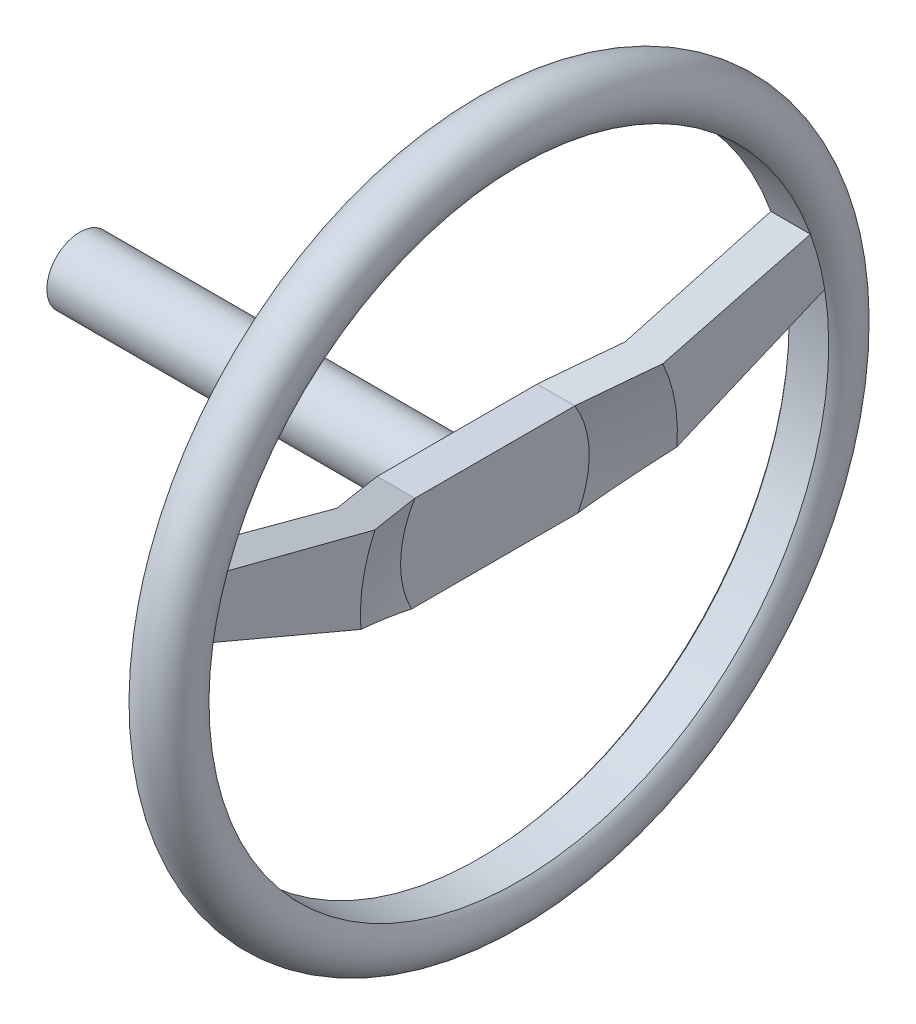
ISO-10303-21;
HEADER;
FILE_DESCRIPTION(('STEP AP214'),'2;1');
FILE_NAME('part.step','',(''),(''),'','','');
FILE_SCHEMA(('AUTOMOTIVE_DESIGN { 1 0 10303 214 1 1 1 1 }'));
ENDSEC;
DATA;
#1=APPLICATION_CONTEXT('core data for automotive mechanical design processes');
#2=APPLICATION_PROTOCOL_DEFINITION('international standard','automotive_design',2000,#1);
#3=PRODUCT_CONTEXT('',#1,'mechanical');
#4=PRODUCT('Part','Part','',(#3));
#5=PRODUCT_RELATED_PRODUCT_CATEGORY('part','',(#4));
#6=PRODUCT_DEFINITION_FORMATION('','',#4);
#7=PRODUCT_DEFINITION_CONTEXT('part definition',#1,'design');
#8=PRODUCT_DEFINITION('design','',#6,#7);
#9=PRODUCT_DEFINITION_SHAPE('','',#8);
#10=(LENGTH_UNIT() NAMED_UNIT(*) SI_UNIT(.MILLI.,.METRE.));
#11=(NAMED_UNIT(*) PLANE_ANGLE_UNIT() SI_UNIT($,.RADIAN.));
#12=(NAMED_UNIT(*) SI_UNIT($,.STERADIAN.) SOLID_ANGLE_UNIT());
#13=UNCERTAINTY_MEASURE_WITH_UNIT(LENGTH_MEASURE(1.E-05),#10,'distance_accuracy_value','');
#14=(GEOMETRIC_REPRESENTATION_CONTEXT(3) GLOBAL_UNCERTAINTY_ASSIGNED_CONTEXT((#13)) GLOBAL_UNIT_ASSIGNED_CONTEXT((#10,
#11,#12)) REPRESENTATION_CONTEXT('',''));
#15=CARTESIAN_POINT('',(0.,0.,0.));
#16=DIRECTION('',(0.,0.,1.));
#17=DIRECTION('',(1.,0.,0.));
#18=AXIS2_PLACEMENT_3D('',#15,#16,#17);
#19=CARTESIAN_POINT('',(-1.04970415300682,0.,0.));
#20=DIRECTION('',(-1.,0.,0.));
#21=DIRECTION('',(0.,0.,1.));
#22=AXIS2_PLACEMENT_3D('',#19,#20,#21);
#23=CONICAL_SURFACE('',#22,16.4284958277448,1.55840925565252);
#24=CARTESIAN_POINT('',(-0.950295846993179,0.,0.));
#25=DIRECTION('',(-1.,0.,0.));
#26=DIRECTION('',(0.,0.,1.));
#27=AXIS2_PLACEMENT_3D('',#24,#25,#26);
#28=CIRCLE('',#27,8.40373998101305);
#29=CARTESIAN_POINT('',(-0.950295846993179,-0.670509925654645,8.37694825745485));
#30=VERTEX_POINT('',#29);
#31=CARTESIAN_POINT('',(-0.950295846993179,3.52681714552161,7.62787037714538));
#32=VERTEX_POINT('',#31);
#33=EDGE_CURVE('E177',#30,#32,#28,.T.);
#34=ORIENTED_EDGE('',*,*,#33,.F.);
#35=CARTESIAN_POINT('',(-0.89432677033387,-3.5779936372377,1.51526952211852));
#36=CARTESIAN_POINT('',(-0.894305329865733,-3.45165509977551,1.81342921687596));
#37=CARTESIAN_POINT('',(-0.894829083646566,-3.32531677368061,2.11158841280532));
#38=CARTESIAN_POINT('',(-0.89678300883065,-3.07264170122533,2.70790307648126));
#39=CARTESIAN_POINT('',(-0.898213176314502,-2.94630495486048,3.0060585442384));
#40=CARTESIAN_POINT('',(-0.901795952319223,-2.69363372027602,3.60236415051655));
#41=CARTESIAN_POINT('',(-0.903948557328908,-2.56729923204842,3.90051428905643));
#42=CARTESIAN_POINT('',(-0.90876261308218,-2.31463159963606,4.49681139418714));
#43=CARTESIAN_POINT('',(-0.911424064494233,-2.18829845545328,4.79495836077329));
#44=CARTESIAN_POINT('',(-0.918665498775503,-1.86561850584843,5.55648494807701));
#45=CARTESIAN_POINT('',(-0.923491288682586,-1.66927255270993,6.0198625574003));
#46=CARTESIAN_POINT('',(-0.933612383169013,-1.27658247351556,6.9466134641211));
#47=CARTESIAN_POINT('',(-0.93890768789597,-1.08023834746028,7.40998676151721));
#48=CARTESIAN_POINT('',(-0.955199616266421,-0.491207534194802,8.80010296053144));
#49=CARTESIAN_POINT('',(-0.966602250213111,-0.0985225679555417,9.72684180064797));
#50=CARTESIAN_POINT('',(-0.989830886993867,0.686851495976288,11.5803292311353));
#51=CARTESIAN_POINT('',(-1.00165689638069,1.07954059363868,12.5070778214348));
#52=CARTESIAN_POINT('',(-1.0255499024684,1.86491694359241,14.3605706469473));
#53=CARTESIAN_POINT('',(-1.03761689871994,2.25760419588583,15.2873148821651));
#54=CARTESIAN_POINT('',(-1.04971330354104,2.65029130944293,16.2140587899644));
#55=B_SPLINE_CURVE_WITH_KNOTS('',3,(#35,#36,#37,#38,#39,#40,#41,#42,#43,#44,#45,#46,#47,#48,#49,
#50,#51,#52,#53,#54),.UNSPECIFIED.,.F.,.F.,(4,2,2,2,2,2,2,2,2,4),(0.,0.971464449387208,
1.94292469812198,2.91438022544529,3.88583702897106,5.3956857321737,6.90553491006791,
9.92523446599908,12.9449807792838,15.9647214623818),.UNSPECIFIED.);
#56=CARTESIAN_POINT('',(-1.04970415300682,2.6499947000159,16.2133587899644));
#57=VERTEX_POINT('',#56);
#58=EDGE_CURVE('E338',#30,#57,#55,.T.);
#59=ORIENTED_EDGE('',*,*,#58,.T.);
#60=CARTESIAN_POINT('',(-1.04970415300682,0.,0.));
#61=DIRECTION('',(-1.,0.,0.));
#62=DIRECTION('',(0.,0.,1.));
#63=AXIS2_PLACEMENT_3D('',#60,#61,#62);
#64=CIRCLE('',#63,16.4284958277448);
#65=CARTESIAN_POINT('',(-1.04970415300682,5.5541580283148,15.4611385013761));
#66=VERTEX_POINT('',#65);
#67=EDGE_CURVE('E181',#57,#66,#64,.T.);
#68=ORIENTED_EDGE('',*,*,#67,.T.);
#69=CARTESIAN_POINT('',(-1.04971307254529,5.55433919645503,15.4618385013761));
#70=CARTESIAN_POINT('',(-1.04130457001567,5.3835385110295,14.8018964185739));
#71=CARTESIAN_POINT('',(-1.03289934461161,5.2127378153797,14.1419542962671));
#72=CARTESIAN_POINT('',(-1.01610221380985,4.87113583017192,12.8220677569026));
#73=CARTESIAN_POINT('',(-1.00771030845533,4.70033454061379,12.1621233398444));
#74=CARTESIAN_POINT('',(-0.990946189223205,4.35872275425882,10.84219893067));
#75=CARTESIAN_POINT('',(-0.982573976424003,4.18791225745866,10.182218938541));
#76=CARTESIAN_POINT('',(-0.965862999417421,3.84629171124856,8.86226068291549));
#77=CARTESIAN_POINT('',(-0.957524235102305,3.67548166183895,8.20228241942035));
#78=CARTESIAN_POINT('',(-0.940913991640434,3.33387464719372,6.88237644724495));
#79=CARTESIAN_POINT('',(-0.932642507310513,3.16307768197381,6.22244873862536));
#80=CARTESIAN_POINT('',(-0.916231395306777,2.82148171056894,4.90258543547685));
#81=CARTESIAN_POINT('',(-0.908091768895648,2.65068270438009,4.24264984093291));
#82=CARTESIAN_POINT('',(-0.896207975991343,2.39448626060657,3.2527544298625));
#83=CARTESIAN_POINT('',(-0.892301052184357,2.30908929656569,2.92279644302121));
#84=CARTESIAN_POINT('',(-0.884712102021077,2.13829474692532,2.26287806775174));
#85=CARTESIAN_POINT('',(-0.881030075593063,2.05289716132603,1.93291767932435));
#86=CARTESIAN_POINT('',(-0.875930777115944,1.92480040819986,1.43797564880691));
#87=CARTESIAN_POINT('',(-0.874301646102884,1.88210177807362,1.27299608313298));
#88=CARTESIAN_POINT('',(-0.871285360504919,1.79670393358234,0.94303469439509));
#89=CARTESIAN_POINT('',(-0.869898206102208,1.75400471921689,0.778052871329516));
#90=CARTESIAN_POINT('',(-0.867524293105551,1.66860590187236,0.44808772366759));
#91=CARTESIAN_POINT('',(-0.866537531285903,1.62590629889919,0.283104399094045));
#92=CARTESIAN_POINT('',(-0.86518166792362,1.54050649697201,-0.0468645528120801));
#93=CARTESIAN_POINT('',(-0.864812564888349,1.4978062980197,-0.211850180138132));
#94=CARTESIAN_POINT('',(-0.864812877762343,1.45506493381777,-0.376994862332846));
#95=CARTESIAN_POINT('',(-0.864812878407986,1.45502372806866,-0.377154073683926));
#96=CARTESIAN_POINT('',(-0.864812879397695,1.45498252231958,-0.377313285034858));
#97=B_SPLINE_CURVE_WITH_KNOTS('',3,(#69,#70,#71,#72,#73,#74,#75,#76,#77,#78,#79,#80,#81,#82,#83,
#84,#85,#86,#87,#88,#89,#90,#91,#92,#93,#94,#95,#96),.UNSPECIFIED.,.F.,.F.,(4,2,2,2,2,2,2,2,2,2,
2,2,2,4),(0.,2.0452149447569,4.09043650784152,6.13576757917695,8.18109205733151,
10.2262574448105,12.2714424054465,13.2939988126596,14.316554893771,14.8278245518069,
15.3390945947949,15.8503605187333,16.3616252071444,16.3621185787211),.UNSPECIFIED.);
#98=EDGE_CURVE('E262',#66,#32,#97,.T.);
#99=ORIENTED_EDGE('',*,*,#98,.T.);
#100=EDGE_LOOP('',(#34,#59,#68,#99));
#101=FACE_BOUND('',#100,.T.);
#102=ADVANCED_FACE('F38',(#101),#23,.F.);
#103=CARTESIAN_POINT('',(-0.950295846993179,0.,0.));
#104=DIRECTION('',(1.,0.,0.));
#105=DIRECTION('',(0.,0.,-1.));
#106=AXIS2_PLACEMENT_3D('',#103,#104,#105);
#107=CONICAL_SURFACE('',#106,8.40373998101305,1.21310748490836);
#108=CARTESIAN_POINT('',(-2.22249996076665,0.,0.));
#109=DIRECTION('',(-1.,0.,0.));
#110=DIRECTION('',(0.,0.,1.));
#111=AXIS2_PLACEMENT_3D('',#108,#109,#110);
#112=CIRCLE('',#111,5.);
#113=CARTESIAN_POINT('',(-2.22249996076665,-2.3500052999841,4.41332925239514));
#114=VERTEX_POINT('',#113);
#115=CARTESIAN_POINT('',(-2.22249996076665,2.6499947000159,4.23999152002544));
#116=VERTEX_POINT('',#115);
#117=EDGE_CURVE('E173',#114,#116,#112,.T.);
#118=ORIENTED_EDGE('',*,*,#117,.F.);
#119=CARTESIAN_POINT('',(-2.63901611776371,-3.5779936372377,1.51526952211852));
#120=CARTESIAN_POINT('',(-2.63902613280477,-3.54540155067136,1.59218703895329));
#121=CARTESIAN_POINT('',(-2.63802097754703,-3.51281076227345,1.66910149210288));
#122=CARTESIAN_POINT('',(-2.63401413553325,-3.44764940023165,1.82288269146318));
#123=CARTESIAN_POINT('',(-2.6310125454365,-3.41507882568549,1.89974943980323));
#124=CARTESIAN_POINT('',(-2.61906868867538,-3.31746002397904,2.13013038851488));
#125=CARTESIAN_POINT('',(-2.60718726173094,-3.25246372120572,2.28352204702649));
#126=CARTESIAN_POINT('',(-2.57627114919037,-3.12295281031221,2.58916856182267));
#127=CARTESIAN_POINT('',(-2.55726005897338,-3.0584373214526,2.7414254966575));
#128=CARTESIAN_POINT('',(-2.5129619133186,-2.92972923377306,3.045177343926));
#129=CARTESIAN_POINT('',(-2.48767392409179,-2.86553668444654,3.19667213955497));
#130=CARTESIAN_POINT('',(-2.43193178834734,-2.73786112640656,3.49798721077445));
#131=CARTESIAN_POINT('',(-2.40150679788967,-2.67437615705979,3.64781211347118));
#132=CARTESIAN_POINT('',(-2.33628852607315,-2.54775368796513,3.94664188855856));
#133=CARTESIAN_POINT('',(-2.30149538161698,-2.48461617739222,4.09564678649634));
#134=CARTESIAN_POINT('',(-2.22829187448127,-2.35860323625481,4.39303807200383));
#135=CARTESIAN_POINT('',(-2.18987826975406,-2.29572809426223,4.54142377854209));
#136=CARTESIAN_POINT('',(-2.11011416461513,-2.17026111391672,4.83752659335543));
#137=CARTESIAN_POINT('',(-2.06876355234105,-2.10766928645112,4.98524367593633));
#138=CARTESIAN_POINT('',(-1.9475040318109,-1.92961407017392,5.40545503821418));
#139=CARTESIAN_POINT('',(-1.86470710840212,-1.81445052943291,5.67724167469317));
#140=CARTESIAN_POINT('',(-1.69351296515769,-1.58481351577811,6.21918638350233));
#141=CARTESIAN_POINT('',(-1.60511784717816,-1.47033980133945,6.48934502583262));
#142=CARTESIAN_POINT('',(-1.42387495115084,-1.24130442079081,7.02986987695712));
#143=CARTESIAN_POINT('',(-1.3310071127616,-1.12674517881476,7.3002303647809));
#144=CARTESIAN_POINT('',(-1.18949583640938,-0.955171568193387,7.70514509942081));
#145=CARTESIAN_POINT('',(-1.14195183584066,-0.898018335606898,7.84002706595844));
#146=CARTESIAN_POINT('',(-1.04622729020469,-0.783793727646718,8.10959781552792));
#147=CARTESIAN_POINT('',(-0.998046752070482,-0.726722351388956,8.24428660064619));
#148=CARTESIAN_POINT('',(-0.949595846993179,-0.669685895095963,8.37889297444131));
#149=B_SPLINE_CURVE_WITH_KNOTS('',3,(#119,#120,#121,#122,#123,#124,#125,#126,#127,#128,#129,
#130,#131,#132,#133,#134,#135,#136,#137,#138,#139,#140,#141,#142,#143,#144,#145,#146,#147,#148),
.UNSPECIFIED.,.F.,.F.,(4,2,2,2,2,2,2,2,2,2,2,2,2,2,4),(0.,0.250600522304592,0.50118891243046,
1.0020507723489,1.50126946835518,2.00056247567717,2.49711145941715,2.99364488465619,
3.4906272481821,3.98762855052738,4.90724874263076,5.82652568477812,6.75040079402343,
7.21243944926054,7.67447307620435),.UNSPECIFIED.);
#150=EDGE_CURVE('E341',#114,#30,#149,.T.);
#151=ORIENTED_EDGE('',*,*,#150,.T.);
#152=ORIENTED_EDGE('',*,*,#33,.T.);
#153=CARTESIAN_POINT('',(-0.950095846993179,3.52695341371631,7.62839689210639));
#154=CARTESIAN_POINT('',(-1.05720751165977,3.45396704934346,7.34639115424665));
#155=CARTESIAN_POINT('',(-1.16417773003443,3.38096761154258,7.06433490309237));
#156=CARTESIAN_POINT('',(-1.37767025136165,3.23492809542793,6.50006537340043));
#157=CARTESIAN_POINT('',(-1.48419255677067,3.16188801733954,6.21785209573358));
#158=CARTESIAN_POINT('',(-1.69662581075634,3.01575164957526,5.65320834928003));
#159=CARTESIAN_POINT('',(-1.80253675702092,2.94265535968797,5.37077787967652));
#160=CARTESIAN_POINT('',(-2.01338059939268,2.79637386905726,4.80557340545718));
#161=CARTESIAN_POINT('',(-2.11831348994928,2.72318866781192,4.52279939890201));
#162=CARTESIAN_POINT('',(-2.22257360520373,2.64994293769013,4.23979152002544));
#163=B_SPLINE_CURVE_WITH_KNOTS('',3,(#153,#154,#155,#156,#157,#158,#159,#160,#161,#162),
.UNSPECIFIED.,.F.,.F.,(4,2,2,2,4),(0.,0.931098634066499,1.86219215509885,2.79328919506956,
3.72439151591158),.UNSPECIFIED.);
#164=EDGE_CURVE('E298',#32,#116,#163,.T.);
#165=ORIENTED_EDGE('',*,*,#164,.T.);
#166=EDGE_LOOP('',(#118,#151,#152,#165));
#167=FACE_BOUND('',#166,.T.);
#168=ADVANCED_FACE('F334',(#167),#107,.T.);
#169=CARTESIAN_POINT('',(-0.222499960766648,0.,0.));
#170=DIRECTION('',(1.,0.,0.));
#171=DIRECTION('',(0.,0.,-1.));
#172=AXIS2_PLACEMENT_3D('',#169,#170,#171);
#173=CONICAL_SURFACE('',#172,5.,1.21310748490836);
#174=CARTESIAN_POINT('',(1.04970415300682,0.,0.));
#175=DIRECTION('',(-1.,0.,0.));
#176=DIRECTION('',(0.,0.,1.));
#177=AXIS2_PLACEMENT_3D('',#174,#175,#176);
#178=CIRCLE('',#177,8.40373998101305);
#179=CARTESIAN_POINT('',(1.04970415300682,-0.670509925654645,8.37694825745484));
#180=VERTEX_POINT('',#179);
#181=CARTESIAN_POINT('',(1.04970415300682,3.52681714552161,7.62787037714538));
#182=VERTEX_POINT('',#181);
#183=EDGE_CURVE('E161',#180,#182,#178,.T.);
#184=ORIENTED_EDGE('',*,*,#183,.F.);
#185=CARTESIAN_POINT('',(1.05040415300682,-0.669685895095966,8.3788929744413));
#186=CARTESIAN_POINT('',(1.00014562908564,-0.728850675788977,8.23926374248903));
#187=CARTESIAN_POINT('',(0.950177517413282,-0.788053028025826,8.09954584147135));
#188=CARTESIAN_POINT('',(0.850930097336604,-0.906546359428734,7.81990087935949));
#189=CARTESIAN_POINT('',(0.80165079781582,-0.965837339726922,7.67997381559348));
#190=CARTESIAN_POINT('',(0.655024361687384,-1.14384375394085,7.25987762647326));
#191=CARTESIAN_POINT('',(0.558873881104759,-1.26271000897297,6.97935256239339));
#192=CARTESIAN_POINT('',(0.371525689638214,-1.50034311936209,6.41853701805418));
#193=CARTESIAN_POINT('',(0.28030424623763,-1.61910710806131,6.13825330312411));
#194=CARTESIAN_POINT('',(0.10413866955041,-1.85738938110701,5.57590573108044));
#195=CARTESIAN_POINT('',(0.019196659256582,-1.97690790586315,5.2938413065986));
#196=CARTESIAN_POINT('',(-0.141996499598154,-2.2176878355156,4.72559925020804));
#197=CARTESIAN_POINT('',(-0.218187455989289,-2.33895552163661,4.43940679457193));
#198=CARTESIAN_POINT('',(-0.32201964221968,-2.52170996325043,4.00810523273892));
#199=CARTESIAN_POINT('',(-0.354876452265978,-2.58274459183842,3.86406314870834));
#200=CARTESIAN_POINT('',(-0.41637370312569,-2.70514107661045,3.57520672158742));
#201=CARTESIAN_POINT('',(-0.445014031025081,-2.76650294151204,3.43039235792361));
#202=CARTESIAN_POINT('',(-0.497410702046739,-2.88989142102425,3.13919481735563));
#203=CARTESIAN_POINT('',(-0.521139500382016,-2.95191983584656,2.99280739194127));
#204=CARTESIAN_POINT('',(-0.562652665460667,-3.07627377724555,2.69933135561702));
#205=CARTESIAN_POINT('',(-0.580437814538601,-3.13859926362389,2.55224283957546));
#206=CARTESIAN_POINT('',(-0.609330129508174,-3.26368733569879,2.25703425051917));
#207=CARTESIAN_POINT('',(-0.620416317047157,-3.32645067822926,2.10891239137195));
#208=CARTESIAN_POINT('',(-0.631555965310387,-3.42070702629566,1.88646685311457));
#209=CARTESIAN_POINT('',(-0.634354256761568,-3.45215324740047,1.81225358553823));
#210=CARTESIAN_POINT('',(-0.638089012373243,-3.51506380297967,1.66378430272634));
#211=CARTESIAN_POINT('',(-0.639025397747083,-3.5465281381642,1.58952828581484));
#212=CARTESIAN_POINT('',(-0.63901611776371,-3.5779936372377,1.51526952211852));
#213=B_SPLINE_CURVE_WITH_KNOTS('',3,(#185,#186,#187,#188,#189,#190,#191,#192,#193,#194,#195,
#196,#197,#198,#199,#200,#201,#202,#203,#204,#205,#206,#207,#208,#209,#210,#211,#212),
.UNSPECIFIED.,.F.,.F.,(4,2,2,2,2,2,2,2,2,2,2,2,2,4),(0.,0.47927441648228,0.958555008420565,
1.91697560308045,2.87027175759274,3.82388874870985,4.78371522792222,5.26322806989189,
5.74275375049759,6.22489989424239,6.70698255034253,7.19056716814345,7.43249595040839,
7.67443496968456),.UNSPECIFIED.);
#214=CARTESIAN_POINT('',(-0.222499960766648,-2.3500052999841,4.41332925239514));
#215=VERTEX_POINT('',#214);
#216=EDGE_CURVE('E142',#180,#215,#213,.T.);
#217=ORIENTED_EDGE('',*,*,#216,.T.);
#218=CARTESIAN_POINT('',(-0.222499960766648,0.,0.));
#219=DIRECTION('',(-1.,0.,0.));
#220=DIRECTION('',(0.,0.,1.));
#221=AXIS2_PLACEMENT_3D('',#218,#219,#220);
#222=CIRCLE('',#221,5.);
#223=CARTESIAN_POINT('',(-0.222499960766648,2.6499947000159,4.23999152002544));
#224=VERTEX_POINT('',#223);
#225=EDGE_CURVE('E169',#215,#224,#222,.T.);
#226=ORIENTED_EDGE('',*,*,#225,.T.);
#227=CARTESIAN_POINT('',(-0.222573605203723,2.64994293769013,4.23979152002544));
#228=CARTESIAN_POINT('',(-0.118313489949276,2.72318866781192,4.52279939890201));
#229=CARTESIAN_POINT('',(-0.0133805993926799,2.79637386905726,4.80557340545718));
#230=CARTESIAN_POINT('',(0.19746324297908,2.94265535968797,5.37077787967652));
#231=CARTESIAN_POINT('',(0.303374189243663,3.01575164957526,5.65320834928003));
#232=CARTESIAN_POINT('',(0.515807443229329,3.16188801733954,6.21785209573358));
#233=CARTESIAN_POINT('',(0.622329748638353,3.23492809542793,6.50006537340043));
#234=CARTESIAN_POINT('',(0.835822269965573,3.38096761154258,7.06433490309237));
#235=CARTESIAN_POINT('',(0.942792488340225,3.45396704934346,7.34639115424665));
#236=CARTESIAN_POINT('',(1.04990415300682,3.52695341371631,7.62839689210638));
#237=B_SPLINE_CURVE_WITH_KNOTS('',3,(#227,#228,#229,#230,#231,#232,#233,#234,#235,#236),
.UNSPECIFIED.,.F.,.F.,(4,2,2,2,4),(0.,0.93110232084202,1.86219936081273,2.79329288184508,
3.72439151591158),.UNSPECIFIED.);
#238=EDGE_CURVE('E302',#224,#182,#237,.T.);
#239=ORIENTED_EDGE('',*,*,#238,.T.);
#240=EDGE_LOOP('',(#184,#217,#226,#239));
#241=FACE_BOUND('',#240,.T.);
#242=ADVANCED_FACE('F331',(#241),#173,.F.);
#243=CARTESIAN_POINT('',(1.04970415300682,16.4284958277448,0.));
#244=DIRECTION('',(-1.,0.,0.));
#245=DIRECTION('',(0.,0.,1.));
#246=AXIS2_PLACEMENT_3D('',#243,#244,#245);
#247=PLANE('',#246);
#248=CARTESIAN_POINT('',(1.04970415300682,0.,0.));
#249=DIRECTION('',(-1.,0.,0.));
#250=DIRECTION('',(0.,0.,1.));
#251=AXIS2_PLACEMENT_3D('',#248,#249,#250);
#252=CIRCLE('',#251,16.4284958277448);
#253=CARTESIAN_POINT('',(1.04970415300682,2.6499947000159,16.2133587899644));
#254=VERTEX_POINT('',#253);
#255=CARTESIAN_POINT('',(1.04970415300682,5.5541580283148,15.4611385013761));
#256=VERTEX_POINT('',#255);
#257=EDGE_CURVE('E152',#254,#256,#252,.T.);
#258=ORIENTED_EDGE('',*,*,#257,.F.);
#259=DIRECTION('',(0.,-0.390148206227637,-0.920752071503158));
#260=VECTOR('',#259,1.);
#261=CARTESIAN_POINT('',(1.04970415300682,-1.07702330335131,7.41757428460731));
#262=LINE('',#261,#260);
#263=EDGE_CURVE('E46',#254,#180,#262,.T.);
#264=ORIENTED_EDGE('',*,*,#263,.T.);
#265=ORIENTED_EDGE('',*,*,#183,.T.);
#266=DIRECTION('',(0.,-0.250556078183036,-0.968102087429594));
#267=VECTOR('',#266,1.);
#268=CARTESIAN_POINT('',(1.04970415300682,5.5541580283148,15.4611385013761));
#269=LINE('',#268,#267);
#270=EDGE_CURVE('E160',#256,#182,#269,.T.);
#271=ORIENTED_EDGE('',*,*,#270,.F.);
#272=EDGE_LOOP('',(#258,#264,#265,#271));
#273=FACE_BOUND('',#272,.T.);
#274=ADVANCED_FACE('F159',(#273),#247,.F.);
#275=CARTESIAN_POINT('',(0.,0.,0.));
#276=DIRECTION('',(-1.,0.,0.));
#277=DIRECTION('',(0.,0.,1.));
#278=AXIS2_PLACEMENT_3D('',#275,#276,#277);
#279=TOROIDAL_SURFACE('',#278,17.5,1.5);
#280=ORIENTED_EDGE('',*,*,#67,.F.);
#281=CARTESIAN_POINT('',(-1.04970415300682,0.,0.));
#282=DIRECTION('',(-1.,0.,0.));
#283=DIRECTION('',(0.,0.,1.));
#284=AXIS2_PLACEMENT_3D('',#281,#282,#283);
#285=CIRCLE('',#284,16.4284958277448);
#286=CARTESIAN_POINT('',(-1.04970415300682,2.6499947000159,-16.2133587899644));
#287=VERTEX_POINT('',#286);
#288=EDGE_CURVE('E134',#57,#287,#285,.F.);
#289=ORIENTED_EDGE('',*,*,#288,.T.);
#290=CARTESIAN_POINT('',(-1.04970415300682,5.55415802831481,-15.4611385013761));
#291=VERTEX_POINT('',#290);
#292=EDGE_CURVE('E184',#291,#287,#64,.T.);
#293=ORIENTED_EDGE('',*,*,#292,.F.);
#294=CARTESIAN_POINT('',(-1.04970415300682,0.,0.));
#295=DIRECTION('',(-1.,0.,0.));
#296=DIRECTION('',(0.,0.,1.));
#297=AXIS2_PLACEMENT_3D('',#294,#295,#296);
#298=CIRCLE('',#297,16.4284958277448);
#299=EDGE_CURVE('E206',#291,#66,#298,.F.);
#300=ORIENTED_EDGE('',*,*,#299,.T.);
#301=EDGE_LOOP('',(#280,#289,#293,#300));
#302=FACE_BOUND('',#301,.T.);
#303=ORIENTED_EDGE('',*,*,#257,.T.);
#304=CARTESIAN_POINT('',(1.04970415300682,0.,0.));
#305=DIRECTION('',(1.,0.,0.));
#306=DIRECTION('',(0.,0.,-1.));
#307=AXIS2_PLACEMENT_3D('',#304,#305,#306);
#308=CIRCLE('',#307,16.4284958277448);
#309=CARTESIAN_POINT('',(1.04970415300682,5.55415802831481,-15.4611385013761));
#310=VERTEX_POINT('',#309);
#311=EDGE_CURVE('E137',#310,#256,#308,.T.);
#312=ORIENTED_EDGE('',*,*,#311,.F.);
#313=CARTESIAN_POINT('',(1.04970415300682,2.6499947000159,-16.2133587899644));
#314=VERTEX_POINT('',#313);
#315=EDGE_CURVE('E154',#310,#314,#252,.T.);
#316=ORIENTED_EDGE('',*,*,#315,.T.);
#317=CARTESIAN_POINT('',(1.04970415300682,0.,0.));
#318=DIRECTION('',(1.,0.,0.));
#319=DIRECTION('',(0.,0.,-1.));
#320=AXIS2_PLACEMENT_3D('',#317,#318,#319);
#321=CIRCLE('',#320,16.4284958277448);
#322=EDGE_CURVE('E131',#254,#314,#321,.T.);
#323=ORIENTED_EDGE('',*,*,#322,.F.);
#324=EDGE_LOOP('',(#303,#312,#316,#323));
#325=FACE_BOUND('',#324,.T.);
#326=ADVANCED_FACE('F40',(#302,#325),#279,.T.);
#327=ORIENTED_EDGE('',*,*,#292,.T.);
#328=CARTESIAN_POINT('',(-1.04971330354104,2.65029130944293,-16.2140587899644));
#329=CARTESIAN_POINT('',(-1.04171044407341,2.39078620573837,-15.6016252121917));
#330=CARTESIAN_POINT('',(-1.03372994744774,2.13128099587988,-14.989191383895));
#331=CARTESIAN_POINT('',(-1.01785182702542,1.61227016603286,-13.7643227593924));
#332=CARTESIAN_POINT('',(-1.00995420323659,1.35276454604428,-13.1518879631863));
#333=CARTESIAN_POINT('',(-0.994279672680418,0.833742665100727,-11.9269932580305));
#334=CARTESIAN_POINT('',(-0.98650277061496,0.57422640412403,-11.3145333490296));
#335=CARTESIAN_POINT('',(-0.971145667438242,0.0551930073135598,-10.0896114663599));
#336=CARTESIAN_POINT('',(-0.963565466319316,-0.204324128520178,-9.47714949269124));
#337=CARTESIAN_POINT('',(-0.948747251882279,-0.723343959242551,-8.2522596260696));
#338=CARTESIAN_POINT('',(-0.941509217553565,-0.982846654038015,-7.63983173333655));
#339=CARTESIAN_POINT('',(-0.927682881471134,-1.5018553720132,-6.4149680928639));
#340=CARTESIAN_POINT('',(-0.921094581482588,-1.76136139520005,-5.80253234510747));
#341=CARTESIAN_POINT('',(-0.909281380388569,-2.280373762178,-4.57766009296684));
#342=CARTESIAN_POINT('',(-0.904056453498103,-2.5398801058702,-3.96522358881603));
#343=CARTESIAN_POINT('',(-0.898421575852167,-2.92914411589058,-3.04655822558518));
#344=CARTESIAN_POINT('',(-0.896910369671147,-3.05889924399815,-2.74033535672097));
#345=CARTESIAN_POINT('',(-0.894862660899179,-3.31841062967183,-2.12788695346441));
#346=CARTESIAN_POINT('',(-0.894326157140372,-3.44816688723641,-1.82166141907568));
#347=CARTESIAN_POINT('',(-0.894326770058695,-3.57794658669016,-1.51538056168866));
#348=CARTESIAN_POINT('',(-0.894326770187454,-3.57797011196393,-1.51532504190359));
#349=CARTESIAN_POINT('',(-0.89432677033387,-3.5779936372377,-1.51526952211852));
#350=B_SPLINE_CURVE_WITH_KNOTS('',3,(#328,#329,#330,#331,#332,#333,#334,#335,#336,#337,#338,
#339,#340,#341,#342,#343,#344,#345,#346,#347,#348,#349),.UNSPECIFIED.,.F.,.F.,(4,2,2,2,2,2,2,2,
2,2,4),(0.,1.99557923927559,3.99115866709701,5.98681562507785,7.98247250528275,9.97800668343837,
11.9735462828278,13.9690481385493,14.9667945915478,15.9645398490749,15.9647207439763),.UNSPECIFIED.);
#351=CARTESIAN_POINT('',(-0.950295846993179,-0.670509925654645,-8.37694825745485));
#352=VERTEX_POINT('',#351);
#353=EDGE_CURVE('E209',#287,#352,#350,.T.);
#354=ORIENTED_EDGE('',*,*,#353,.T.);
#355=CARTESIAN_POINT('',(-0.950295846993179,3.52681714552161,-7.62787037714538));
#356=VERTEX_POINT('',#355);
#357=EDGE_CURVE('E180',#356,#352,#28,.T.);
#358=ORIENTED_EDGE('',*,*,#357,.F.);
#359=CARTESIAN_POINT('',(-0.864812879397695,1.45498252231958,0.377313285034858));
#360=CARTESIAN_POINT('',(-0.864795785119835,1.51775547946405,0.134770253205891));
#361=CARTESIAN_POINT('',(-0.865624768024629,1.58052767168346,-0.107769823094907));
#362=CARTESIAN_POINT('',(-0.868389015132746,1.70607023122574,-0.592842924635661));
#363=CARTESIAN_POINT('',(-0.87032427222073,1.76884059855775,-0.835375949910934));
#364=CARTESIAN_POINT('',(-0.874715176808278,1.89437908662133,-1.32043332001521));
#365=CARTESIAN_POINT('',(-0.877170816563016,1.95714720737243,-1.56295766491967));
#366=CARTESIAN_POINT('',(-0.882336558872334,2.08268280183106,-2.0480038546726));
#367=CARTESIAN_POINT('',(-0.885046661412021,2.14545027553863,-2.2905256995212));
#368=CARTESIAN_POINT('',(-0.893369456559031,2.3337522423221,-3.0180894785847));
#369=CARTESIAN_POINT('',(-0.899174632962859,2.45928618802823,-3.50312929786457));
#370=CARTESIAN_POINT('',(-0.91095752740242,2.71035505677461,-4.47321271266165));
#371=CARTESIAN_POINT('',(-0.916935247487318,2.83588997980876,-4.95825630815525));
#372=CARTESIAN_POINT('',(-0.928977032213413,3.08695950442004,-5.9283422570923));
#373=CARTESIAN_POINT('',(-0.935041096812397,3.2124941059973,-6.41338461053623));
#374=CARTESIAN_POINT('',(-0.950081419972462,3.52272317619112,-7.61205204105286));
#375=CARTESIAN_POINT('',(-0.959083321958983,3.70741756656124,-8.32567681579583));
#376=CARTESIAN_POINT('',(-0.977132464034544,4.07680624328501,-9.75292596338146));
#377=CARTESIAN_POINT('',(-0.986179704132227,4.26150052963863,-10.466550336224));
#378=CARTESIAN_POINT('',(-1.00429925580423,4.63088559112081,-11.8937855151885));
#379=CARTESIAN_POINT('',(-1.01337156690935,4.81557636625082,-12.607396321316));
#380=CARTESIAN_POINT('',(-1.03153240884887,5.18495783013196,-14.0346175998192));
#381=CARTESIAN_POINT('',(-1.04062093968008,5.36964851888311,-14.7482280721949));
#382=CARTESIAN_POINT('',(-1.04971307254529,5.55433919645503,-15.4618385013761));
#383=B_SPLINE_CURVE_WITH_KNOTS('',3,(#359,#360,#361,#362,#363,#364,#365,#366,#367,#368,#369,
#370,#371,#372,#373,#374,#375,#376,#377,#378,#379,#380,#381,#382),.UNSPECIFIED.,.F.,.F.,(4,2,2,
2,2,2,2,2,2,2,2,4),(0.,0.75159794456755,1.50319105505808,2.25477298041669,3.00635486178764,
4.50951973847375,6.01270247439495,7.51588447543107,9.72746317172649,11.9390422895439,
14.1505802941693,16.3621178639017),.UNSPECIFIED.);
#384=EDGE_CURVE('E212',#356,#291,#383,.T.);
#385=ORIENTED_EDGE('',*,*,#384,.T.);
#386=EDGE_LOOP('',(#327,#354,#358,#385));
#387=FACE_BOUND('',#386,.T.);
#388=ADVANCED_FACE('F252',(#387),#23,.F.);
#389=ORIENTED_EDGE('',*,*,#357,.T.);
#390=CARTESIAN_POINT('',(-0.949595846993179,-0.669685895095963,-8.3788929744413));
#391=CARTESIAN_POINT('',(-0.999854370914356,-0.728850675788976,-8.23926374248903));
#392=CARTESIAN_POINT('',(-1.04982248258672,-0.788053028025825,-8.09954584147135));
#393=CARTESIAN_POINT('',(-1.1490699026634,-0.906546359428732,-7.8199008793595));
#394=CARTESIAN_POINT('',(-1.19834920218418,-0.96583733972692,-7.67997381559348));
#395=CARTESIAN_POINT('',(-1.34497563831262,-1.14384375394084,-7.25987762647327));
#396=CARTESIAN_POINT('',(-1.44112611889524,-1.26271000897297,-6.97935256239339));
#397=CARTESIAN_POINT('',(-1.62847431036179,-1.50034311936209,-6.41853701805419));
#398=CARTESIAN_POINT('',(-1.71969575376237,-1.61910710806131,-6.13825330312411));
#399=CARTESIAN_POINT('',(-1.89586133044959,-1.857389381107,-5.57590573108045));
#400=CARTESIAN_POINT('',(-1.98080334074342,-1.97690790586315,-5.2938413065986));
#401=CARTESIAN_POINT('',(-2.14199649959816,-2.2176878355156,-4.72559925020804));
#402=CARTESIAN_POINT('',(-2.21818745598929,-2.33895552163661,-4.43940679457193));
#403=CARTESIAN_POINT('',(-2.32201964221968,-2.52170996325043,-4.00810523273892));
#404=CARTESIAN_POINT('',(-2.35487645226598,-2.58274459183842,-3.86406314870834));
#405=CARTESIAN_POINT('',(-2.41637370312569,-2.70514107661045,-3.57520672158742));
#406=CARTESIAN_POINT('',(-2.44501403102508,-2.76650294151204,-3.43039235792361));
#407=CARTESIAN_POINT('',(-2.49741070204674,-2.88989142102425,-3.13919481735563));
#408=CARTESIAN_POINT('',(-2.52113950038202,-2.95191983584656,-2.99280739194127));
#409=CARTESIAN_POINT('',(-2.56265266546067,-3.07627377724555,-2.69933135561702));
#410=CARTESIAN_POINT('',(-2.5804378145386,-3.13859926362389,-2.55224283957546));
#411=CARTESIAN_POINT('',(-2.60933012950818,-3.26368733569879,-2.25703425051917));
#412=CARTESIAN_POINT('',(-2.62041631704716,-3.32645067822926,-2.10891239137195));
#413=CARTESIAN_POINT('',(-2.63155596531039,-3.42070702629566,-1.88646685311457));
#414=CARTESIAN_POINT('',(-2.63435425676157,-3.45215324740047,-1.81225358553823));
#415=CARTESIAN_POINT('',(-2.63808901237325,-3.51506380297967,-1.66378430272634));
#416=CARTESIAN_POINT('',(-2.63902539774709,-3.5465281381642,-1.58952828581484));
#417=CARTESIAN_POINT('',(-2.63901611776371,-3.5779936372377,-1.51526952211852));
#418=B_SPLINE_CURVE_WITH_KNOTS('',3,(#390,#391,#392,#393,#394,#395,#396,#397,#398,#399,#400,
#401,#402,#403,#404,#405,#406,#407,#408,#409,#410,#411,#412,#413,#414,#415,#416,#417),
.UNSPECIFIED.,.F.,.F.,(4,2,2,2,2,2,2,2,2,2,2,2,2,4),(0.,0.479274416482282,0.958555008420566,
1.91697560308045,2.87027175759274,3.82388874870986,4.78371522792222,5.26322806989189,
5.74275375049759,6.22489989424239,6.70698255034254,7.19056716814345,7.43249595040839,
7.67443496968457),.UNSPECIFIED.);
#419=CARTESIAN_POINT('',(-2.22249996076665,-2.3500052999841,-4.41332925239514));
#420=VERTEX_POINT('',#419);
#421=EDGE_CURVE('E205',#352,#420,#418,.T.);
#422=ORIENTED_EDGE('',*,*,#421,.T.);
#423=CARTESIAN_POINT('',(-2.22249996076665,2.6499947000159,-4.23999152002544));
#424=VERTEX_POINT('',#423);
#425=EDGE_CURVE('E176',#424,#420,#112,.T.);
#426=ORIENTED_EDGE('',*,*,#425,.F.);
#427=CARTESIAN_POINT('',(-2.22257360520373,2.64994293769013,-4.23979152002544));
#428=CARTESIAN_POINT('',(-2.11831348994928,2.72318866781192,-4.52279939890201));
#429=CARTESIAN_POINT('',(-2.01338059939268,2.79637386905726,-4.80557340545718));
#430=CARTESIAN_POINT('',(-1.80253675702092,2.94265535968797,-5.37077787967652));
#431=CARTESIAN_POINT('',(-1.69662581075634,3.01575164957526,-5.65320834928003));
#432=CARTESIAN_POINT('',(-1.48419255677067,3.16188801733954,-6.21785209573358));
#433=CARTESIAN_POINT('',(-1.37767025136165,3.23492809542793,-6.50006537340043));
#434=CARTESIAN_POINT('',(-1.16417773003443,3.38096761154258,-7.06433490309237));
#435=CARTESIAN_POINT('',(-1.05720751165977,3.45396704934346,-7.34639115424665));
#436=CARTESIAN_POINT('',(-0.950095846993179,3.52695341371631,-7.62839689210638));
#437=B_SPLINE_CURVE_WITH_KNOTS('',3,(#427,#428,#429,#430,#431,#432,#433,#434,#435,#436),
.UNSPECIFIED.,.F.,.F.,(4,2,2,2,4),(0.,0.93110232084202,1.86219936081273,2.79329288184508,
3.72439151591158),.UNSPECIFIED.);
#438=EDGE_CURVE('E278',#424,#356,#437,.T.);
#439=ORIENTED_EDGE('',*,*,#438,.T.);
#440=EDGE_LOOP('',(#389,#422,#426,#439));
#441=FACE_BOUND('',#440,.T.);
#442=ADVANCED_FACE('F255',(#441),#107,.T.);
#443=CARTESIAN_POINT('',(-2.22249996076665,5.,0.));
#444=DIRECTION('',(1.,0.,0.));
#445=DIRECTION('',(0.,0.,-1.));
#446=AXIS2_PLACEMENT_3D('',#443,#444,#445);
#447=PLANE('',#446);
#448=CARTESIAN_POINT('',(-2.22249996076665,0.,0.));
#449=DIRECTION('',(1.,0.,0.));
#450=DIRECTION('',(0.,0.,-1.));
#451=AXIS2_PLACEMENT_3D('',#448,#449,#450);
#452=CIRCLE('',#451,1.75);
#453=CARTESIAN_POINT('',(-2.22249996076665,0.,-1.75));
#454=VERTEX_POINT('',#453);
#455=EDGE_CURVE('E11',#454,#454,#452,.F.);
#456=ORIENTED_EDGE('',*,*,#455,.F.);
#457=EDGE_LOOP('',(#456));
#458=FACE_BOUND('',#457,.T.);
#459=ORIENTED_EDGE('',*,*,#425,.T.);
#460=DIRECTION('',(0.,0.,1.));
#461=VECTOR('',#460,1.);
#462=CARTESIAN_POINT('',(-2.22249996076665,-2.3500052999841,0.));
#463=LINE('',#462,#461);
#464=EDGE_CURVE('E165',#420,#114,#463,.T.);
#465=ORIENTED_EDGE('',*,*,#464,.T.);
#466=ORIENTED_EDGE('',*,*,#117,.T.);
#467=DIRECTION('',(0.,0.,-1.));
#468=VECTOR('',#467,1.);
#469=CARTESIAN_POINT('',(-2.22249996076665,2.6499947000159,0.));
#470=LINE('',#469,#468);
#471=EDGE_CURVE('E397',#116,#424,#470,.T.);
#472=ORIENTED_EDGE('',*,*,#471,.T.);
#473=EDGE_LOOP('',(#459,#465,#466,#472));
#474=FACE_BOUND('',#473,.T.);
#475=ADVANCED_FACE('F405',(#458,#474),#447,.F.);
#476=CARTESIAN_POINT('',(-0.222499960766649,5.,0.));
#477=DIRECTION('',(-1.,0.,0.));
#478=DIRECTION('',(0.,0.,1.));
#479=AXIS2_PLACEMENT_3D('',#476,#477,#478);
#480=PLANE('',#479);
#481=ORIENTED_EDGE('',*,*,#225,.F.);
#482=DIRECTION('',(0.,0.,-1.));
#483=VECTOR('',#482,1.);
#484=CARTESIAN_POINT('',(-0.222499960766649,-2.3500052999841,0.));
#485=LINE('',#484,#483);
#486=CARTESIAN_POINT('',(-0.222499960766648,-2.3500052999841,-4.41332925239514));
#487=VERTEX_POINT('',#486);
#488=EDGE_CURVE('E393',#215,#487,#485,.T.);
#489=ORIENTED_EDGE('',*,*,#488,.T.);
#490=CARTESIAN_POINT('',(-0.222499960766648,2.6499947000159,-4.23999152002544));
#491=VERTEX_POINT('',#490);
#492=EDGE_CURVE('E172',#491,#487,#222,.T.);
#493=ORIENTED_EDGE('',*,*,#492,.F.);
#494=DIRECTION('',(0.,0.,1.));
#495=VECTOR('',#494,1.);
#496=CARTESIAN_POINT('',(-0.222499960766649,2.6499947000159,0.));
#497=LINE('',#496,#495);
#498=EDGE_CURVE('E399',#491,#224,#497,.T.);
#499=ORIENTED_EDGE('',*,*,#498,.T.);
#500=EDGE_LOOP('',(#481,#489,#493,#499));
#501=FACE_BOUND('',#500,.T.);
#502=ADVANCED_FACE('F330',(#501),#480,.F.);
#503=ORIENTED_EDGE('',*,*,#492,.T.);
#504=CARTESIAN_POINT('',(-0.63901611776371,-3.5779936372377,-1.51526952211852));
#505=CARTESIAN_POINT('',(-0.639026132804767,-3.54540155067136,-1.59218703895329));
#506=CARTESIAN_POINT('',(-0.638020977547023,-3.51281076227345,-1.66910149210288));
#507=CARTESIAN_POINT('',(-0.634014135533244,-3.44764940023165,-1.82288269146318));
#508=CARTESIAN_POINT('',(-0.631012545436494,-3.41507882568549,-1.89974943980323));
#509=CARTESIAN_POINT('',(-0.619068688675377,-3.31746002397904,-2.13013038851488));
#510=CARTESIAN_POINT('',(-0.607187261730938,-3.25246372120572,-2.28352204702649));
#511=CARTESIAN_POINT('',(-0.576271149190369,-3.12295281031221,-2.58916856182267));
#512=CARTESIAN_POINT('',(-0.557260058973378,-3.0584373214526,-2.7414254966575));
#513=CARTESIAN_POINT('',(-0.512961913318599,-2.92972923377306,-3.04517734392601));
#514=CARTESIAN_POINT('',(-0.487673924091786,-2.86553668444654,-3.19667213955498));
#515=CARTESIAN_POINT('',(-0.431931788347333,-2.73786112640656,-3.49798721077445));
#516=CARTESIAN_POINT('',(-0.401506797889669,-2.67437615705978,-3.64781211347118));
#517=CARTESIAN_POINT('',(-0.336288526073149,-2.54775368796513,-3.94664188855856));
#518=CARTESIAN_POINT('',(-0.301495381616982,-2.48461617739222,-4.09564678649635));
#519=CARTESIAN_POINT('',(-0.228291874481267,-2.35860323625481,-4.39303807200383));
#520=CARTESIAN_POINT('',(-0.189878269754063,-2.29572809426223,-4.54142377854209));
#521=CARTESIAN_POINT('',(-0.110114164615128,-2.17026111391671,-4.83752659335543));
#522=CARTESIAN_POINT('',(-0.0687635523410514,-2.10766928645112,-4.98524367593633));
#523=CARTESIAN_POINT('',(0.0524959681890994,-1.92961407017392,-5.40545503821418));
#524=CARTESIAN_POINT('',(0.135292891597881,-1.81445052943291,-5.67724167469317));
#525=CARTESIAN_POINT('',(0.306487034842316,-1.58481351577811,-6.21918638350233));
#526=CARTESIAN_POINT('',(0.394882152821842,-1.47033980133945,-6.48934502583262));
#527=CARTESIAN_POINT('',(0.576125048849165,-1.24130442079081,-7.02986987695711));
#528=CARTESIAN_POINT('',(0.668992887238396,-1.12674517881476,-7.3002303647809));
#529=CARTESIAN_POINT('',(0.810504163590618,-0.955171568193389,-7.70514509942081));
#530=CARTESIAN_POINT('',(0.858048164159342,-0.8980183356069,-7.84002706595844));
#531=CARTESIAN_POINT('',(0.953772709795314,-0.783793727646719,-8.10959781552792));
#532=CARTESIAN_POINT('',(1.00195324792952,-0.726722351388958,-8.24428660064618));
#533=CARTESIAN_POINT('',(1.05040415300682,-0.669685895095964,-8.3788929744413));
#534=B_SPLINE_CURVE_WITH_KNOTS('',3,(#504,#505,#506,#507,#508,#509,#510,#511,#512,#513,#514,
#515,#516,#517,#518,#519,#520,#521,#522,#523,#524,#525,#526,#527,#528,#529,#530,#531,#532,#533),
.UNSPECIFIED.,.F.,.F.,(4,2,2,2,2,2,2,2,2,2,2,2,2,2,4),(0.,0.250600522304592,0.50118891243046,
1.0020507723489,1.50126946835518,2.00056247567718,2.49711145941715,2.99364488465619,
3.4906272481821,3.98762855052739,4.90724874263077,5.82652568477812,6.75040079402342,
7.21243944926054,7.67447307620434),.UNSPECIFIED.);
#535=CARTESIAN_POINT('',(1.04970415300682,-0.670509925654645,-8.37694825745484));
#536=VERTEX_POINT('',#535);
#537=EDGE_CURVE('E201',#487,#536,#534,.T.);
#538=ORIENTED_EDGE('',*,*,#537,.T.);
#539=CARTESIAN_POINT('',(1.04970415300682,3.52681714552161,-7.62787037714537));
#540=VERTEX_POINT('',#539);
#541=EDGE_CURVE('E163',#540,#536,#178,.T.);
#542=ORIENTED_EDGE('',*,*,#541,.F.);
#543=CARTESIAN_POINT('',(1.04990415300682,3.52695341371631,-7.62839689210638));
#544=CARTESIAN_POINT('',(0.942792488340225,3.45396704934346,-7.34639115424665));
#545=CARTESIAN_POINT('',(0.835822269965573,3.38096761154258,-7.06433490309237));
#546=CARTESIAN_POINT('',(0.622329748638353,3.23492809542793,-6.50006537340043));
#547=CARTESIAN_POINT('',(0.515807443229329,3.16188801733954,-6.21785209573358));
#548=CARTESIAN_POINT('',(0.303374189243662,3.01575164957526,-5.65320834928003));
#549=CARTESIAN_POINT('',(0.19746324297908,2.94265535968797,-5.37077787967652));
#550=CARTESIAN_POINT('',(-0.0133805993926797,2.79637386905726,-4.80557340545718));
#551=CARTESIAN_POINT('',(-0.118313489949276,2.72318866781192,-4.52279939890201));
#552=CARTESIAN_POINT('',(-0.222573605203723,2.64994293769013,-4.23979152002544));
#553=B_SPLINE_CURVE_WITH_KNOTS('',3,(#543,#544,#545,#546,#547,#548,#549,#550,#551,#552),
.UNSPECIFIED.,.F.,.F.,(4,2,2,2,4),(0.,0.931098634066495,1.86219215509885,2.79328919506955,
3.72439151591157),.UNSPECIFIED.);
#554=EDGE_CURVE('E199',#540,#491,#553,.T.);
#555=ORIENTED_EDGE('',*,*,#554,.T.);
#556=EDGE_LOOP('',(#503,#538,#542,#555));
#557=FACE_BOUND('',#556,.T.);
#558=ADVANCED_FACE('F198',(#557),#173,.F.);
#559=ORIENTED_EDGE('',*,*,#541,.T.);
#560=DIRECTION('',(0.,-0.390148206227637,0.920752071503158));
#561=VECTOR('',#560,1.);
#562=CARTESIAN_POINT('',(1.04970415300682,2.6499947000159,-16.2133587899644));
#563=LINE('',#562,#561);
#564=EDGE_CURVE('E155',#314,#536,#563,.T.);
#565=ORIENTED_EDGE('',*,*,#564,.F.);
#566=ORIENTED_EDGE('',*,*,#315,.F.);
#567=DIRECTION('',(0.,-0.250556078183036,0.968102087429594));
#568=VECTOR('',#567,1.);
#569=CARTESIAN_POINT('',(1.04970415300682,2.48651752381668,-3.60834611484015));
#570=LINE('',#569,#568);
#571=EDGE_CURVE('E147',#310,#540,#570,.T.);
#572=ORIENTED_EDGE('',*,*,#571,.T.);
#573=EDGE_LOOP('',(#559,#565,#566,#572));
#574=FACE_BOUND('',#573,.T.);
#575=ADVANCED_FACE('F190',(#574),#247,.F.);
#576=CARTESIAN_POINT('',(-8.95029584699318,2.6499947000159,4.23999152002544));
#577=DIRECTION('',(0.,-1.,0.));
#578=DIRECTION('',(0.,0.,-1.));
#579=AXIS2_PLACEMENT_3D('',#576,#577,#578);
#580=PLANE('',#579);
#581=DIRECTION('',(1.,0.,0.));
#582=VECTOR('',#581,1.);
#583=CARTESIAN_POINT('',(-8.95029584699318,2.6499947000159,4.23999152002544));
#584=LINE('',#583,#582);
#585=EDGE_CURVE('E380',#116,#224,#584,.T.);
#586=ORIENTED_EDGE('',*,*,#585,.T.);
#587=ORIENTED_EDGE('',*,*,#498,.F.);
#588=DIRECTION('',(1.,0.,0.));
#589=VECTOR('',#588,1.);
#590=CARTESIAN_POINT('',(-8.95029584699318,2.6499947000159,-4.23999152002544));
#591=LINE('',#590,#589);
#592=EDGE_CURVE('E61',#424,#491,#591,.T.);
#593=ORIENTED_EDGE('',*,*,#592,.F.);
#594=ORIENTED_EDGE('',*,*,#471,.F.);
#595=EDGE_LOOP('',(#586,#587,#593,#594));
#596=FACE_BOUND('',#595,.T.);
#597=ADVANCED_FACE('F289',(#596),#580,.F.);
#598=CARTESIAN_POINT('',(-8.95029584699318,0.,0.));
#599=DIRECTION('',(1.,0.,0.));
#600=DIRECTION('',(0.,0.,-1.));
#601=AXIS2_PLACEMENT_3D('',#598,#599,#600);
#602=CYLINDRICAL_SURFACE('',#601,16.4284958277448);
#603=DIRECTION('',(1.,0.,0.));
#604=VECTOR('',#603,1.);
#605=CARTESIAN_POINT('',(-8.95029584699318,5.55415802831481,-15.4611385013761));
#606=LINE('',#605,#604);
#607=EDGE_CURVE('E306',#291,#310,#606,.T.);
#608=ORIENTED_EDGE('',*,*,#607,.T.);
#609=ORIENTED_EDGE('',*,*,#311,.T.);
#610=DIRECTION('',(1.,0.,0.));
#611=VECTOR('',#610,1.);
#612=CARTESIAN_POINT('',(-8.95029584699318,5.5541580283148,15.4611385013761));
#613=LINE('',#612,#611);
#614=EDGE_CURVE('E377',#66,#256,#613,.T.);
#615=ORIENTED_EDGE('',*,*,#614,.F.);
#616=ORIENTED_EDGE('',*,*,#299,.F.);
#617=EDGE_LOOP('',(#608,#609,#615,#616));
#618=FACE_BOUND('',#617,.T.);
#619=ADVANCED_FACE('F288',(#618),#602,.F.);
#620=CARTESIAN_POINT('',(-8.95029584699318,5.55415802831481,-15.4611385013761));
#621=DIRECTION('',(0.,-0.968102087429594,-0.250556078183036));
#622=DIRECTION('',(0.,0.250556078183036,-0.968102087429594));
#623=AXIS2_PLACEMENT_3D('',#620,#621,#622);
#624=PLANE('',#623);
#625=ORIENTED_EDGE('',*,*,#438,.F.);
#626=ORIENTED_EDGE('',*,*,#592,.T.);
#627=ORIENTED_EDGE('',*,*,#554,.F.);
#628=ORIENTED_EDGE('',*,*,#571,.F.);
#629=ORIENTED_EDGE('',*,*,#607,.F.);
#630=ORIENTED_EDGE('',*,*,#384,.F.);
#631=EDGE_LOOP('',(#625,#626,#627,#628,#629,#630));
#632=FACE_BOUND('',#631,.T.);
#633=ADVANCED_FACE('F283',(#632),#624,.F.);
#634=CARTESIAN_POINT('',(-8.95029584699318,5.5541580283148,15.4611385013761));
#635=DIRECTION('',(0.,-0.968102087429594,0.250556078183036));
#636=DIRECTION('',(0.,-0.250556078183036,-0.968102087429594));
#637=AXIS2_PLACEMENT_3D('',#634,#635,#636);
#638=PLANE('',#637);
#639=ORIENTED_EDGE('',*,*,#614,.T.);
#640=ORIENTED_EDGE('',*,*,#270,.T.);
#641=ORIENTED_EDGE('',*,*,#238,.F.);
#642=ORIENTED_EDGE('',*,*,#585,.F.);
#643=ORIENTED_EDGE('',*,*,#164,.F.);
#644=ORIENTED_EDGE('',*,*,#98,.F.);
#645=EDGE_LOOP('',(#639,#640,#641,#642,#643,#644));
#646=FACE_BOUND('',#645,.T.);
#647=ADVANCED_FACE('F287',(#646),#638,.F.);
#648=CARTESIAN_POINT('',(-8.95029584699318,-2.3500052999841,4.41332925239514));
#649=DIRECTION('',(0.,1.,0.));
#650=DIRECTION('',(0.,0.,1.));
#651=AXIS2_PLACEMENT_3D('',#648,#649,#650);
#652=PLANE('',#651);
#653=DIRECTION('',(1.,0.,0.));
#654=VECTOR('',#653,1.);
#655=CARTESIAN_POINT('',(-8.95029584699318,-2.3500052999841,-4.41332925239514));
#656=LINE('',#655,#654);
#657=EDGE_CURVE('E372',#420,#487,#656,.T.);
#658=ORIENTED_EDGE('',*,*,#657,.T.);
#659=ORIENTED_EDGE('',*,*,#488,.F.);
#660=DIRECTION('',(1.,0.,0.));
#661=VECTOR('',#660,1.);
#662=CARTESIAN_POINT('',(-8.95029584699318,-2.3500052999841,4.41332925239514));
#663=LINE('',#662,#661);
#664=EDGE_CURVE('E53',#114,#215,#663,.T.);
#665=ORIENTED_EDGE('',*,*,#664,.F.);
#666=ORIENTED_EDGE('',*,*,#464,.F.);
#667=EDGE_LOOP('',(#658,#659,#665,#666));
#668=FACE_BOUND('',#667,.T.);
#669=ADVANCED_FACE('F236',(#668),#652,.F.);
#670=CARTESIAN_POINT('',(-8.95029584699318,0.,0.));
#671=DIRECTION('',(1.,0.,0.));
#672=DIRECTION('',(0.,0.,-1.));
#673=AXIS2_PLACEMENT_3D('',#670,#671,#672);
#674=CYLINDRICAL_SURFACE('',#673,16.4284958277448);
#675=DIRECTION('',(1.,0.,0.));
#676=VECTOR('',#675,1.);
#677=CARTESIAN_POINT('',(-8.95029584699318,2.6499947000159,16.2133587899644));
#678=LINE('',#677,#676);
#679=EDGE_CURVE('E126',#57,#254,#678,.T.);
#680=ORIENTED_EDGE('',*,*,#679,.T.);
#681=ORIENTED_EDGE('',*,*,#322,.T.);
#682=DIRECTION('',(1.,0.,0.));
#683=VECTOR('',#682,1.);
#684=CARTESIAN_POINT('',(-8.95029584699318,2.6499947000159,-16.2133587899644));
#685=LINE('',#684,#683);
#686=EDGE_CURVE('E369',#287,#314,#685,.T.);
#687=ORIENTED_EDGE('',*,*,#686,.F.);
#688=ORIENTED_EDGE('',*,*,#288,.F.);
#689=EDGE_LOOP('',(#680,#681,#687,#688));
#690=FACE_BOUND('',#689,.T.);
#691=ADVANCED_FACE('F128',(#690),#674,.F.);
#692=CARTESIAN_POINT('',(-8.95029584699318,2.6499947000159,16.2133587899644));
#693=DIRECTION('',(0.,0.920752071503158,-0.390148206227637));
#694=DIRECTION('',(0.,0.390148206227637,0.920752071503158));
#695=AXIS2_PLACEMENT_3D('',#692,#693,#694);
#696=PLANE('',#695);
#697=ORIENTED_EDGE('',*,*,#150,.F.);
#698=ORIENTED_EDGE('',*,*,#664,.T.);
#699=ORIENTED_EDGE('',*,*,#216,.F.);
#700=ORIENTED_EDGE('',*,*,#263,.F.);
#701=ORIENTED_EDGE('',*,*,#679,.F.);
#702=ORIENTED_EDGE('',*,*,#58,.F.);
#703=EDGE_LOOP('',(#697,#698,#699,#700,#701,#702));
#704=FACE_BOUND('',#703,.T.);
#705=ADVANCED_FACE('F140',(#704),#696,.F.);
#706=CARTESIAN_POINT('',(-8.95029584699318,2.6499947000159,-16.2133587899644));
#707=DIRECTION('',(0.,0.920752071503158,0.390148206227637));
#708=DIRECTION('',(0.,-0.390148206227637,0.920752071503158));
#709=AXIS2_PLACEMENT_3D('',#706,#707,#708);
#710=PLANE('',#709);
#711=ORIENTED_EDGE('',*,*,#686,.T.);
#712=ORIENTED_EDGE('',*,*,#564,.T.);
#713=ORIENTED_EDGE('',*,*,#537,.F.);
#714=ORIENTED_EDGE('',*,*,#657,.F.);
#715=ORIENTED_EDGE('',*,*,#421,.F.);
#716=ORIENTED_EDGE('',*,*,#353,.F.);
#717=EDGE_LOOP('',(#711,#712,#713,#714,#715,#716));
#718=FACE_BOUND('',#717,.T.);
#719=ADVANCED_FACE('F230',(#718),#710,.F.);
#720=CARTESIAN_POINT('',(-22.2224999607667,0.,0.));
#721=DIRECTION('',(1.,0.,0.));
#722=DIRECTION('',(0.,0.,-1.));
#723=AXIS2_PLACEMENT_3D('',#720,#721,#722);
#724=CYLINDRICAL_SURFACE('',#723,1.75);
#725=CARTESIAN_POINT('',(-22.2224999607667,0.,0.));
#726=DIRECTION('',(-1.,0.,0.));
#727=DIRECTION('',(0.,0.,1.));
#728=AXIS2_PLACEMENT_3D('',#725,#726,#727);
#729=CIRCLE('',#728,1.75);
#730=CARTESIAN_POINT('',(-22.2224999607667,0.,1.75));
#731=VERTEX_POINT('',#730);
#732=EDGE_CURVE('E156',#731,#731,#729,.T.);
#733=ORIENTED_EDGE('',*,*,#732,.F.);
#734=EDGE_LOOP('',(#733));
#735=FACE_BOUND('',#734,.T.);
#736=ORIENTED_EDGE('',*,*,#455,.T.);
#737=EDGE_LOOP('',(#736));
#738=FACE_BOUND('',#737,.T.);
#739=ADVANCED_FACE('F235',(#735,#738),#724,.T.);
#740=CARTESIAN_POINT('',(-22.2224999607667,0.,0.));
#741=DIRECTION('',(-1.,0.,0.));
#742=DIRECTION('',(0.,0.,1.));
#743=AXIS2_PLACEMENT_3D('',#740,#741,#742);
#744=PLANE('',#743);
#745=ORIENTED_EDGE('',*,*,#732,.T.);
#746=EDGE_LOOP('',(#745));
#747=FACE_BOUND('',#746,.T.);
#748=ADVANCED_FACE('F359',(#747),#744,.T.);
#749=CLOSED_SHELL('',(#102,#168,#242,#274,#326,#388,#442,#475,#502,#558,#575,#597,#619,#633,
#647,#669,#691,#705,#719,#739,#748));
#750=MANIFOLD_SOLID_BREP('B2',#749);
#751=ADVANCED_BREP_SHAPE_REPRESENTATION('',(#18,#750),#14);
#752=SHAPE_DEFINITION_REPRESENTATION(#9,#751);
ENDSEC;
END-ISO-10303-21;
